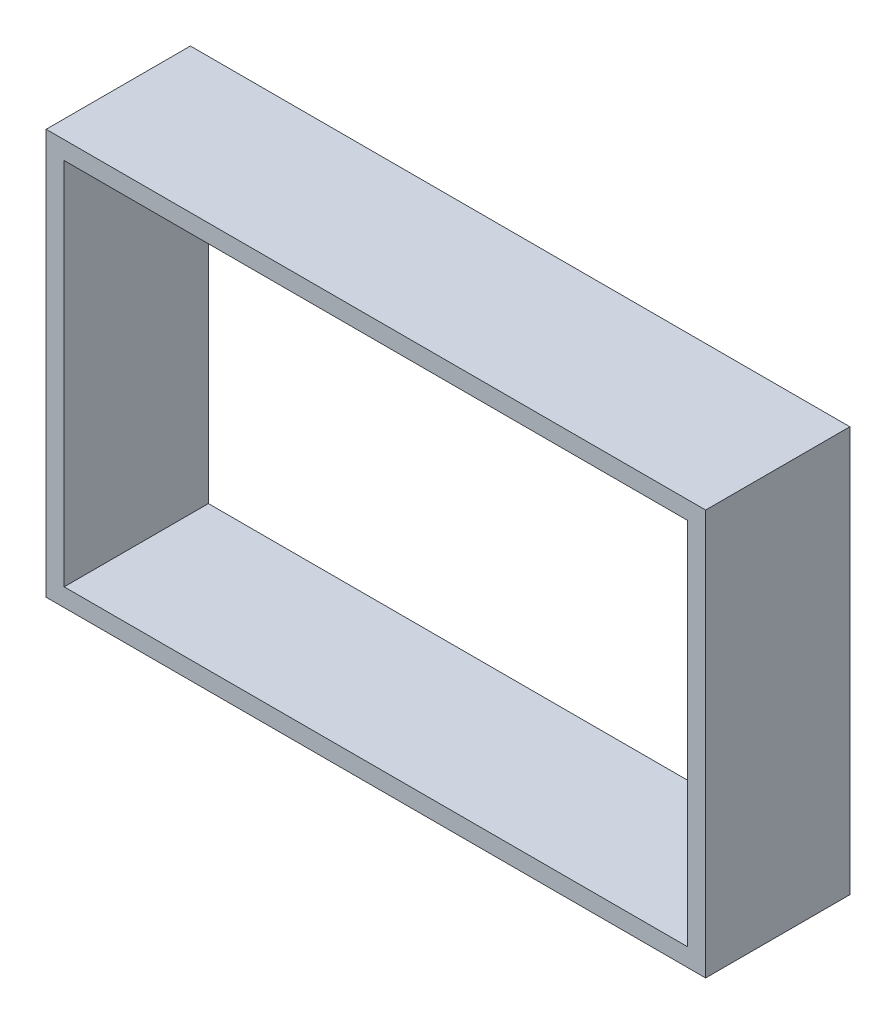
ISO-10303-21;
HEADER;
FILE_DESCRIPTION(('STEP AP214'),'2;1');
FILE_NAME('part.step','',(''),(''),'','','');
FILE_SCHEMA(('AUTOMOTIVE_DESIGN { 1 0 10303 214 1 1 1 1 }'));
ENDSEC;
DATA;
#1=APPLICATION_CONTEXT('core data for automotive mechanical design processes');
#2=APPLICATION_PROTOCOL_DEFINITION('international standard','automotive_design',2000,#1);
#3=PRODUCT_CONTEXT('',#1,'mechanical');
#4=PRODUCT('Part','Part','',(#3));
#5=PRODUCT_RELATED_PRODUCT_CATEGORY('part','',(#4));
#6=PRODUCT_DEFINITION_FORMATION('','',#4);
#7=PRODUCT_DEFINITION_CONTEXT('part definition',#1,'design');
#8=PRODUCT_DEFINITION('design','',#6,#7);
#9=PRODUCT_DEFINITION_SHAPE('','',#8);
#10=(LENGTH_UNIT() NAMED_UNIT(*) SI_UNIT(.MILLI.,.METRE.));
#11=(NAMED_UNIT(*) PLANE_ANGLE_UNIT() SI_UNIT($,.RADIAN.));
#12=(NAMED_UNIT(*) SI_UNIT($,.STERADIAN.) SOLID_ANGLE_UNIT());
#13=UNCERTAINTY_MEASURE_WITH_UNIT(LENGTH_MEASURE(1.E-05),#10,'distance_accuracy_value','');
#14=(GEOMETRIC_REPRESENTATION_CONTEXT(3) GLOBAL_UNCERTAINTY_ASSIGNED_CONTEXT((#13)) GLOBAL_UNIT_ASSIGNED_CONTEXT((#10,
#11,#12)) REPRESENTATION_CONTEXT('',''));
#15=CARTESIAN_POINT('',(0.,0.,0.));
#16=DIRECTION('',(0.,0.,1.));
#17=DIRECTION('',(1.,0.,0.));
#18=AXIS2_PLACEMENT_3D('',#15,#16,#17);
#19=CARTESIAN_POINT('',(0.,32.512,-25.4));
#20=DIRECTION('',(0.,1.,0.));
#21=DIRECTION('',(-1.,0.,0.));
#22=AXIS2_PLACEMENT_3D('',#19,#20,#21);
#23=PLANE('',#22);
#24=DIRECTION('',(-1.,0.,0.));
#25=VECTOR('',#24,1.);
#26=CARTESIAN_POINT('',(0.,32.512,0.));
#27=LINE('',#26,#25);
#28=CARTESIAN_POINT('',(54.89575,32.512,0.));
#29=VERTEX_POINT('',#28);
#30=CARTESIAN_POINT('',(-54.89575,32.512,0.));
#31=VERTEX_POINT('',#30);
#32=EDGE_CURVE('E144',#29,#31,#27,.T.);
#33=ORIENTED_EDGE('',*,*,#32,.T.);
#34=DIRECTION('',(0.,0.,1.));
#35=VECTOR('',#34,1.);
#36=CARTESIAN_POINT('',(-54.89575,32.512,-25.4));
#37=LINE('',#36,#35);
#38=CARTESIAN_POINT('',(-54.89575,32.512,-25.4));
#39=VERTEX_POINT('',#38);
#40=EDGE_CURVE('E11',#39,#31,#37,.T.);
#41=ORIENTED_EDGE('',*,*,#40,.F.);
#42=DIRECTION('',(-1.,0.,0.));
#43=VECTOR('',#42,1.);
#44=CARTESIAN_POINT('',(0.,32.512,-25.4));
#45=LINE('',#44,#43);
#46=CARTESIAN_POINT('',(54.89575,32.512,-25.4));
#47=VERTEX_POINT('',#46);
#48=EDGE_CURVE('E125',#47,#39,#45,.T.);
#49=ORIENTED_EDGE('',*,*,#48,.F.);
#50=DIRECTION('',(0.,0.,1.));
#51=VECTOR('',#50,1.);
#52=CARTESIAN_POINT('',(54.89575,32.512,-25.4));
#53=LINE('',#52,#51);
#54=EDGE_CURVE('E116',#47,#29,#53,.T.);
#55=ORIENTED_EDGE('',*,*,#54,.T.);
#56=EDGE_LOOP('',(#33,#41,#49,#55));
#57=FACE_BOUND('',#56,.T.);
#58=ADVANCED_FACE('F35',(#57),#23,.F.);
#59=CARTESIAN_POINT('',(-54.89575,0.,-25.4));
#60=DIRECTION('',(-1.,0.,0.));
#61=DIRECTION('',(0.,-1.,0.));
#62=AXIS2_PLACEMENT_3D('',#59,#60,#61);
#63=PLANE('',#62);
#64=DIRECTION('',(0.,-1.,0.));
#65=VECTOR('',#64,1.);
#66=CARTESIAN_POINT('',(-54.89575,0.,0.));
#67=LINE('',#66,#65);
#68=CARTESIAN_POINT('',(-54.89575,-32.512,0.));
#69=VERTEX_POINT('',#68);
#70=EDGE_CURVE('E87',#31,#69,#67,.T.);
#71=ORIENTED_EDGE('',*,*,#70,.T.);
#72=DIRECTION('',(0.,0.,1.));
#73=VECTOR('',#72,1.);
#74=CARTESIAN_POINT('',(-54.89575,-32.512,-25.4));
#75=LINE('',#74,#73);
#76=CARTESIAN_POINT('',(-54.89575,-32.512,-25.4));
#77=VERTEX_POINT('',#76);
#78=EDGE_CURVE('E45',#77,#69,#75,.T.);
#79=ORIENTED_EDGE('',*,*,#78,.F.);
#80=DIRECTION('',(0.,-1.,0.));
#81=VECTOR('',#80,1.);
#82=CARTESIAN_POINT('',(-54.89575,0.,-25.4));
#83=LINE('',#82,#81);
#84=EDGE_CURVE('E53',#39,#77,#83,.T.);
#85=ORIENTED_EDGE('',*,*,#84,.F.);
#86=ORIENTED_EDGE('',*,*,#40,.T.);
#87=EDGE_LOOP('',(#71,#79,#85,#86));
#88=FACE_BOUND('',#87,.T.);
#89=ADVANCED_FACE('F179',(#88),#63,.F.);
#90=CARTESIAN_POINT('',(0.,-32.512,-25.4));
#91=DIRECTION('',(0.,1.,0.));
#92=DIRECTION('',(-1.,0.,0.));
#93=AXIS2_PLACEMENT_3D('',#90,#91,#92);
#94=PLANE('',#93);
#95=DIRECTION('',(-1.,0.,0.));
#96=VECTOR('',#95,1.);
#97=CARTESIAN_POINT('',(0.,-32.512,0.));
#98=LINE('',#97,#96);
#99=CARTESIAN_POINT('',(54.89575,-32.512,0.));
#100=VERTEX_POINT('',#99);
#101=EDGE_CURVE('E111',#100,#69,#98,.T.);
#102=ORIENTED_EDGE('',*,*,#101,.F.);
#103=DIRECTION('',(0.,0.,1.));
#104=VECTOR('',#103,1.);
#105=CARTESIAN_POINT('',(54.89575,-32.512,-25.4));
#106=LINE('',#105,#104);
#107=CARTESIAN_POINT('',(54.89575,-32.512,-25.4));
#108=VERTEX_POINT('',#107);
#109=EDGE_CURVE('E107',#108,#100,#106,.T.);
#110=ORIENTED_EDGE('',*,*,#109,.F.);
#111=DIRECTION('',(-1.,0.,0.));
#112=VECTOR('',#111,1.);
#113=CARTESIAN_POINT('',(0.,-32.512,-25.4));
#114=LINE('',#113,#112);
#115=EDGE_CURVE('E110',#108,#77,#114,.T.);
#116=ORIENTED_EDGE('',*,*,#115,.T.);
#117=ORIENTED_EDGE('',*,*,#78,.T.);
#118=EDGE_LOOP('',(#102,#110,#116,#117));
#119=FACE_BOUND('',#118,.T.);
#120=ADVANCED_FACE('F109',(#119),#94,.T.);
#121=CARTESIAN_POINT('',(58.07075,0.,-25.4));
#122=DIRECTION('',(-1.,0.,0.));
#123=DIRECTION('',(0.,-1.,0.));
#124=AXIS2_PLACEMENT_3D('',#121,#122,#123);
#125=PLANE('',#124);
#126=DIRECTION('',(0.,-1.,0.));
#127=VECTOR('',#126,1.);
#128=CARTESIAN_POINT('',(58.07075,0.,0.));
#129=LINE('',#128,#127);
#130=CARTESIAN_POINT('',(58.07075,35.687,0.));
#131=VERTEX_POINT('',#130);
#132=CARTESIAN_POINT('',(58.07075,-35.687,0.));
#133=VERTEX_POINT('',#132);
#134=EDGE_CURVE('E132',#131,#133,#129,.T.);
#135=ORIENTED_EDGE('',*,*,#134,.T.);
#136=DIRECTION('',(0.,0.,1.));
#137=VECTOR('',#136,1.);
#138=CARTESIAN_POINT('',(58.07075,-35.687,-25.4));
#139=LINE('',#138,#137);
#140=CARTESIAN_POINT('',(58.07075,-35.687,-25.4));
#141=VERTEX_POINT('',#140);
#142=EDGE_CURVE('E154',#141,#133,#139,.T.);
#143=ORIENTED_EDGE('',*,*,#142,.F.);
#144=DIRECTION('',(0.,-1.,0.));
#145=VECTOR('',#144,1.);
#146=CARTESIAN_POINT('',(58.07075,0.,-25.4));
#147=LINE('',#146,#145);
#148=CARTESIAN_POINT('',(58.07075,35.687,-25.4));
#149=VERTEX_POINT('',#148);
#150=EDGE_CURVE('E150',#149,#141,#147,.T.);
#151=ORIENTED_EDGE('',*,*,#150,.F.);
#152=DIRECTION('',(0.,0.,1.));
#153=VECTOR('',#152,1.);
#154=CARTESIAN_POINT('',(58.07075,35.687,-25.4));
#155=LINE('',#154,#153);
#156=EDGE_CURVE('E39',#149,#131,#155,.T.);
#157=ORIENTED_EDGE('',*,*,#156,.T.);
#158=EDGE_LOOP('',(#135,#143,#151,#157));
#159=FACE_BOUND('',#158,.T.);
#160=ADVANCED_FACE('F37',(#159),#125,.F.);
#161=CARTESIAN_POINT('',(0.,-35.687,-25.4));
#162=DIRECTION('',(0.,1.,0.));
#163=DIRECTION('',(-1.,0.,0.));
#164=AXIS2_PLACEMENT_3D('',#161,#162,#163);
#165=PLANE('',#164);
#166=DIRECTION('',(-1.,0.,0.));
#167=VECTOR('',#166,1.);
#168=CARTESIAN_POINT('',(0.,-35.687,0.));
#169=LINE('',#168,#167);
#170=CARTESIAN_POINT('',(-58.07075,-35.687,0.));
#171=VERTEX_POINT('',#170);
#172=EDGE_CURVE('E141',#133,#171,#169,.T.);
#173=ORIENTED_EDGE('',*,*,#172,.T.);
#174=DIRECTION('',(0.,0.,1.));
#175=VECTOR('',#174,1.);
#176=CARTESIAN_POINT('',(-58.07075,-35.687,-25.4));
#177=LINE('',#176,#175);
#178=CARTESIAN_POINT('',(-58.07075,-35.687,-25.4));
#179=VERTEX_POINT('',#178);
#180=EDGE_CURVE('E157',#179,#171,#177,.T.);
#181=ORIENTED_EDGE('',*,*,#180,.F.);
#182=DIRECTION('',(-1.,0.,0.));
#183=VECTOR('',#182,1.);
#184=CARTESIAN_POINT('',(0.,-35.687,-25.4));
#185=LINE('',#184,#183);
#186=EDGE_CURVE('E127',#141,#179,#185,.T.);
#187=ORIENTED_EDGE('',*,*,#186,.F.);
#188=ORIENTED_EDGE('',*,*,#142,.T.);
#189=EDGE_LOOP('',(#173,#181,#187,#188));
#190=FACE_BOUND('',#189,.T.);
#191=ADVANCED_FACE('F175',(#190),#165,.F.);
#192=CARTESIAN_POINT('',(-58.07075,0.,-25.4));
#193=DIRECTION('',(-1.,0.,0.));
#194=DIRECTION('',(0.,-1.,0.));
#195=AXIS2_PLACEMENT_3D('',#192,#193,#194);
#196=PLANE('',#195);
#197=DIRECTION('',(0.,-1.,0.));
#198=VECTOR('',#197,1.);
#199=CARTESIAN_POINT('',(-58.07075,0.,0.));
#200=LINE('',#199,#198);
#201=CARTESIAN_POINT('',(-58.07075,35.687,0.));
#202=VERTEX_POINT('',#201);
#203=EDGE_CURVE('E138',#202,#171,#200,.T.);
#204=ORIENTED_EDGE('',*,*,#203,.F.);
#205=DIRECTION('',(0.,0.,1.));
#206=VECTOR('',#205,1.);
#207=CARTESIAN_POINT('',(-58.07075,35.687,-25.4));
#208=LINE('',#207,#206);
#209=CARTESIAN_POINT('',(-58.07075,35.687,-25.4));
#210=VERTEX_POINT('',#209);
#211=EDGE_CURVE('E158',#210,#202,#208,.T.);
#212=ORIENTED_EDGE('',*,*,#211,.F.);
#213=DIRECTION('',(0.,-1.,0.));
#214=VECTOR('',#213,1.);
#215=CARTESIAN_POINT('',(-58.07075,0.,-25.4));
#216=LINE('',#215,#214);
#217=EDGE_CURVE('E196',#210,#179,#216,.T.);
#218=ORIENTED_EDGE('',*,*,#217,.T.);
#219=ORIENTED_EDGE('',*,*,#180,.T.);
#220=EDGE_LOOP('',(#204,#212,#218,#219));
#221=FACE_BOUND('',#220,.T.);
#222=ADVANCED_FACE('F169',(#221),#196,.T.);
#223=CARTESIAN_POINT('',(0.,35.687,-25.4));
#224=DIRECTION('',(0.,1.,0.));
#225=DIRECTION('',(-1.,0.,0.));
#226=AXIS2_PLACEMENT_3D('',#223,#224,#225);
#227=PLANE('',#226);
#228=DIRECTION('',(-1.,0.,0.));
#229=VECTOR('',#228,1.);
#230=CARTESIAN_POINT('',(0.,35.687,0.));
#231=LINE('',#230,#229);
#232=EDGE_CURVE('E135',#131,#202,#231,.T.);
#233=ORIENTED_EDGE('',*,*,#232,.F.);
#234=ORIENTED_EDGE('',*,*,#156,.F.);
#235=DIRECTION('',(-1.,0.,0.));
#236=VECTOR('',#235,1.);
#237=CARTESIAN_POINT('',(0.,35.687,-25.4));
#238=LINE('',#237,#236);
#239=EDGE_CURVE('E198',#149,#210,#238,.T.);
#240=ORIENTED_EDGE('',*,*,#239,.T.);
#241=ORIENTED_EDGE('',*,*,#211,.T.);
#242=EDGE_LOOP('',(#233,#234,#240,#241));
#243=FACE_BOUND('',#242,.T.);
#244=ADVANCED_FACE('F167',(#243),#227,.T.);
#245=CARTESIAN_POINT('',(54.89575,0.,-25.4));
#246=DIRECTION('',(-1.,0.,0.));
#247=DIRECTION('',(0.,-1.,0.));
#248=AXIS2_PLACEMENT_3D('',#245,#246,#247);
#249=PLANE('',#248);
#250=DIRECTION('',(0.,-1.,0.));
#251=VECTOR('',#250,1.);
#252=CARTESIAN_POINT('',(54.89575,0.,0.));
#253=LINE('',#252,#251);
#254=EDGE_CURVE('E147',#29,#100,#253,.T.);
#255=ORIENTED_EDGE('',*,*,#254,.F.);
#256=ORIENTED_EDGE('',*,*,#54,.F.);
#257=DIRECTION('',(0.,-1.,0.));
#258=VECTOR('',#257,1.);
#259=CARTESIAN_POINT('',(54.89575,0.,-25.4));
#260=LINE('',#259,#258);
#261=EDGE_CURVE('E121',#47,#108,#260,.T.);
#262=ORIENTED_EDGE('',*,*,#261,.T.);
#263=ORIENTED_EDGE('',*,*,#109,.T.);
#264=EDGE_LOOP('',(#255,#256,#262,#263));
#265=FACE_BOUND('',#264,.T.);
#266=ADVANCED_FACE('F123',(#265),#249,.T.);
#267=CARTESIAN_POINT('',(0.,0.,-25.4));
#268=DIRECTION('',(0.,0.,1.));
#269=DIRECTION('',(1.,0.,0.));
#270=AXIS2_PLACEMENT_3D('',#267,#268,#269);
#271=PLANE('',#270);
#272=ORIENTED_EDGE('',*,*,#150,.T.);
#273=ORIENTED_EDGE('',*,*,#186,.T.);
#274=ORIENTED_EDGE('',*,*,#217,.F.);
#275=ORIENTED_EDGE('',*,*,#239,.F.);
#276=EDGE_LOOP('',(#272,#273,#274,#275));
#277=FACE_BOUND('',#276,.T.);
#278=ORIENTED_EDGE('',*,*,#48,.T.);
#279=ORIENTED_EDGE('',*,*,#84,.T.);
#280=ORIENTED_EDGE('',*,*,#115,.F.);
#281=ORIENTED_EDGE('',*,*,#261,.F.);
#282=EDGE_LOOP('',(#278,#279,#280,#281));
#283=FACE_BOUND('',#282,.T.);
#284=ADVANCED_FACE('F120',(#277,#283),#271,.F.);
#285=CARTESIAN_POINT('',(0.,0.,0.));
#286=DIRECTION('',(0.,0.,1.));
#287=DIRECTION('',(1.,0.,0.));
#288=AXIS2_PLACEMENT_3D('',#285,#286,#287);
#289=PLANE('',#288);
#290=ORIENTED_EDGE('',*,*,#134,.F.);
#291=ORIENTED_EDGE('',*,*,#232,.T.);
#292=ORIENTED_EDGE('',*,*,#203,.T.);
#293=ORIENTED_EDGE('',*,*,#172,.F.);
#294=EDGE_LOOP('',(#290,#291,#292,#293));
#295=FACE_BOUND('',#294,.T.);
#296=ORIENTED_EDGE('',*,*,#32,.F.);
#297=ORIENTED_EDGE('',*,*,#254,.T.);
#298=ORIENTED_EDGE('',*,*,#101,.T.);
#299=ORIENTED_EDGE('',*,*,#70,.F.);
#300=EDGE_LOOP('',(#296,#297,#298,#299));
#301=FACE_BOUND('',#300,.T.);
#302=ADVANCED_FACE('F166',(#295,#301),#289,.T.);
#303=CLOSED_SHELL('',(#58,#89,#120,#160,#191,#222,#244,#266,#284,#302));
#304=MANIFOLD_SOLID_BREP('B2',#303);
#305=ADVANCED_BREP_SHAPE_REPRESENTATION('',(#18,#304),#14);
#306=SHAPE_DEFINITION_REPRESENTATION(#9,#305);
ENDSEC;
END-ISO-10303-21;
